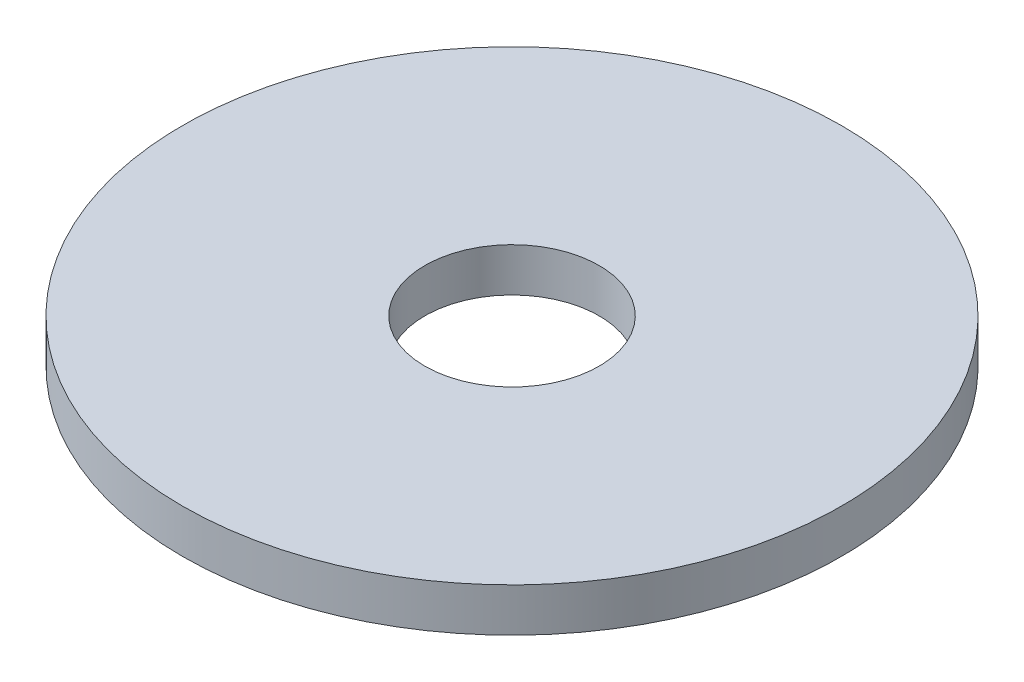
ISO-10303-21;
HEADER;
FILE_DESCRIPTION(('STEP AP214'),'2;1');
FILE_NAME('part.step','',(''),(''),'','','');
FILE_SCHEMA(('AUTOMOTIVE_DESIGN { 1 0 10303 214 1 1 1 1 }'));
ENDSEC;
DATA;
#1=APPLICATION_CONTEXT('core data for automotive mechanical design processes');
#2=APPLICATION_PROTOCOL_DEFINITION('international standard','automotive_design',2000,#1);
#3=PRODUCT_CONTEXT('',#1,'mechanical');
#4=PRODUCT('Part','Part','',(#3));
#5=PRODUCT_RELATED_PRODUCT_CATEGORY('part','',(#4));
#6=PRODUCT_DEFINITION_FORMATION('','',#4);
#7=PRODUCT_DEFINITION_CONTEXT('part definition',#1,'design');
#8=PRODUCT_DEFINITION('design','',#6,#7);
#9=PRODUCT_DEFINITION_SHAPE('','',#8);
#10=(LENGTH_UNIT() NAMED_UNIT(*) SI_UNIT(.MILLI.,.METRE.));
#11=(NAMED_UNIT(*) PLANE_ANGLE_UNIT() SI_UNIT($,.RADIAN.));
#12=(NAMED_UNIT(*) SI_UNIT($,.STERADIAN.) SOLID_ANGLE_UNIT());
#13=UNCERTAINTY_MEASURE_WITH_UNIT(LENGTH_MEASURE(1.E-05),#10,'distance_accuracy_value','');
#14=(GEOMETRIC_REPRESENTATION_CONTEXT(3) GLOBAL_UNCERTAINTY_ASSIGNED_CONTEXT((#13)) GLOBAL_UNIT_ASSIGNED_CONTEXT((#10,
#11,#12)) REPRESENTATION_CONTEXT('',''));
#15=CARTESIAN_POINT('',(0.,0.,0.));
#16=DIRECTION('',(0.,0.,1.));
#17=DIRECTION('',(1.,0.,0.));
#18=AXIS2_PLACEMENT_3D('',#15,#16,#17);
#19=CARTESIAN_POINT('',(0.,0.79375,0.));
#20=DIRECTION('',(0.,1.,0.));
#21=DIRECTION('',(0.,0.,1.));
#22=AXIS2_PLACEMENT_3D('',#19,#20,#21);
#23=PLANE('',#22);
#24=CARTESIAN_POINT('',(0.,0.79375,0.));
#25=DIRECTION('',(0.,1.,0.));
#26=DIRECTION('',(0.,0.,1.));
#27=AXIS2_PLACEMENT_3D('',#24,#25,#26);
#28=CIRCLE('',#27,6.);
#29=CARTESIAN_POINT('',(0.,0.79375,6.));
#30=VERTEX_POINT('',#29);
#31=EDGE_CURVE('E10',#30,#30,#28,.T.);
#32=ORIENTED_EDGE('',*,*,#31,.T.);
#33=EDGE_LOOP('',(#32));
#34=FACE_BOUND('',#33,.T.);
#35=CARTESIAN_POINT('',(0.,0.79375,0.));
#36=DIRECTION('',(0.,1.,0.));
#37=DIRECTION('',(0.,0.,1.));
#38=AXIS2_PLACEMENT_3D('',#35,#36,#37);
#39=CIRCLE('',#38,1.5875);
#40=CARTESIAN_POINT('',(0.,0.79375,1.5875));
#41=VERTEX_POINT('',#40);
#42=EDGE_CURVE('E50',#41,#41,#39,.T.);
#43=ORIENTED_EDGE('',*,*,#42,.F.);
#44=EDGE_LOOP('',(#43));
#45=FACE_BOUND('',#44,.T.);
#46=ADVANCED_FACE('F39',(#34,#45),#23,.T.);
#47=CARTESIAN_POINT('',(0.,0.,0.));
#48=DIRECTION('',(0.,1.,0.));
#49=DIRECTION('',(0.,0.,1.));
#50=AXIS2_PLACEMENT_3D('',#47,#48,#49);
#51=PLANE('',#50);
#52=CARTESIAN_POINT('',(0.,0.,0.));
#53=DIRECTION('',(0.,1.,0.));
#54=DIRECTION('',(0.,0.,1.));
#55=AXIS2_PLACEMENT_3D('',#52,#53,#54);
#56=CIRCLE('',#55,6.);
#57=CARTESIAN_POINT('',(0.,0.,6.));
#58=VERTEX_POINT('',#57);
#59=EDGE_CURVE('E43',#58,#58,#56,.T.);
#60=ORIENTED_EDGE('',*,*,#59,.F.);
#61=EDGE_LOOP('',(#60));
#62=FACE_BOUND('',#61,.T.);
#63=CARTESIAN_POINT('',(0.,0.,0.));
#64=DIRECTION('',(0.,1.,0.));
#65=DIRECTION('',(0.,0.,1.));
#66=AXIS2_PLACEMENT_3D('',#63,#64,#65);
#67=CIRCLE('',#66,1.5875);
#68=CARTESIAN_POINT('',(0.,0.,1.5875));
#69=VERTEX_POINT('',#68);
#70=EDGE_CURVE('E52',#69,#69,#67,.T.);
#71=ORIENTED_EDGE('',*,*,#70,.T.);
#72=EDGE_LOOP('',(#71));
#73=FACE_BOUND('',#72,.T.);
#74=ADVANCED_FACE('F62',(#62,#73),#51,.F.);
#75=CARTESIAN_POINT('',(0.,0.79375,0.));
#76=DIRECTION('',(0.,-1.,0.));
#77=DIRECTION('',(0.,0.,-1.));
#78=AXIS2_PLACEMENT_3D('',#75,#76,#77);
#79=CYLINDRICAL_SURFACE('',#78,6.);
#80=ORIENTED_EDGE('',*,*,#31,.F.);
#81=EDGE_LOOP('',(#80));
#82=FACE_BOUND('',#81,.T.);
#83=ORIENTED_EDGE('',*,*,#59,.T.);
#84=EDGE_LOOP('',(#83));
#85=FACE_BOUND('',#84,.T.);
#86=ADVANCED_FACE('F41',(#82,#85),#79,.T.);
#87=CARTESIAN_POINT('',(0.,0.79375,0.));
#88=DIRECTION('',(0.,-1.,0.));
#89=DIRECTION('',(0.,0.,-1.));
#90=AXIS2_PLACEMENT_3D('',#87,#88,#89);
#91=CYLINDRICAL_SURFACE('',#90,1.5875);
#92=ORIENTED_EDGE('',*,*,#42,.T.);
#93=EDGE_LOOP('',(#92));
#94=FACE_BOUND('',#93,.T.);
#95=ORIENTED_EDGE('',*,*,#70,.F.);
#96=EDGE_LOOP('',(#95));
#97=FACE_BOUND('',#96,.T.);
#98=ADVANCED_FACE('F58',(#94,#97),#91,.F.);
#99=CLOSED_SHELL('',(#46,#74,#86,#98));
#100=MANIFOLD_SOLID_BREP('B2',#99);
#101=ADVANCED_BREP_SHAPE_REPRESENTATION('',(#18,#100),#14);
#102=SHAPE_DEFINITION_REPRESENTATION(#9,#101);
ENDSEC;
END-ISO-10303-21;
